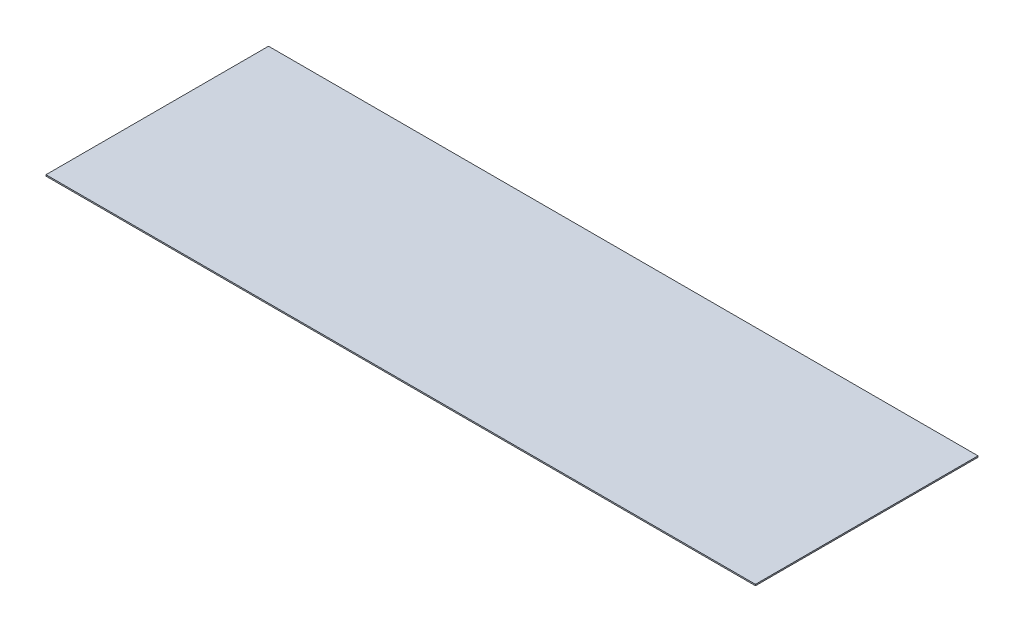
ISO-10303-21;
HEADER;
FILE_DESCRIPTION(('STEP AP214'),'2;1');
FILE_NAME('part.step','',(''),(''),'','','');
FILE_SCHEMA(('AUTOMOTIVE_DESIGN { 1 0 10303 214 1 1 1 1 }'));
ENDSEC;
DATA;
#1=APPLICATION_CONTEXT('core data for automotive mechanical design processes');
#2=APPLICATION_PROTOCOL_DEFINITION('international standard','automotive_design',2000,#1);
#3=PRODUCT_CONTEXT('',#1,'mechanical');
#4=PRODUCT('Part','Part','',(#3));
#5=PRODUCT_RELATED_PRODUCT_CATEGORY('part','',(#4));
#6=PRODUCT_DEFINITION_FORMATION('','',#4);
#7=PRODUCT_DEFINITION_CONTEXT('part definition',#1,'design');
#8=PRODUCT_DEFINITION('design','',#6,#7);
#9=PRODUCT_DEFINITION_SHAPE('','',#8);
#10=(LENGTH_UNIT() NAMED_UNIT(*) SI_UNIT(.MILLI.,.METRE.));
#11=(NAMED_UNIT(*) PLANE_ANGLE_UNIT() SI_UNIT($,.RADIAN.));
#12=(NAMED_UNIT(*) SI_UNIT($,.STERADIAN.) SOLID_ANGLE_UNIT());
#13=UNCERTAINTY_MEASURE_WITH_UNIT(LENGTH_MEASURE(1.E-05),#10,'distance_accuracy_value','');
#14=(GEOMETRIC_REPRESENTATION_CONTEXT(3) GLOBAL_UNCERTAINTY_ASSIGNED_CONTEXT((#13)) GLOBAL_UNIT_ASSIGNED_CONTEXT((#10,
#11,#12)) REPRESENTATION_CONTEXT('',''));
#15=CARTESIAN_POINT('',(0.,0.,0.));
#16=DIRECTION('',(0.,0.,1.));
#17=DIRECTION('',(1.,0.,0.));
#18=AXIS2_PLACEMENT_3D('',#15,#16,#17);
#19=CARTESIAN_POINT('',(271.,1.,85.));
#20=DIRECTION('',(-1.,0.,0.));
#21=DIRECTION('',(0.,0.,1.));
#22=AXIS2_PLACEMENT_3D('',#19,#20,#21);
#23=PLANE('',#22);
#24=DIRECTION('',(0.,0.,-1.));
#25=VECTOR('',#24,1.);
#26=CARTESIAN_POINT('',(271.,0.,85.));
#27=LINE('',#26,#25);
#28=CARTESIAN_POINT('',(271.,0.,85.));
#29=VERTEX_POINT('',#28);
#30=CARTESIAN_POINT('',(271.,0.,-85.0000000000001));
#31=VERTEX_POINT('',#30);
#32=EDGE_CURVE('E99',#29,#31,#27,.T.);
#33=ORIENTED_EDGE('',*,*,#32,.T.);
#34=DIRECTION('',(0.,-1.,0.));
#35=VECTOR('',#34,1.);
#36=CARTESIAN_POINT('',(271.,1.,-85.0000000000001));
#37=LINE('',#36,#35);
#38=CARTESIAN_POINT('',(271.,1.,-85.0000000000001));
#39=VERTEX_POINT('',#38);
#40=EDGE_CURVE('E11',#39,#31,#37,.T.);
#41=ORIENTED_EDGE('',*,*,#40,.F.);
#42=DIRECTION('',(0.,0.,-1.));
#43=VECTOR('',#42,1.);
#44=CARTESIAN_POINT('',(271.,1.,85.));
#45=LINE('',#44,#43);
#46=CARTESIAN_POINT('',(271.,1.,85.));
#47=VERTEX_POINT('',#46);
#48=EDGE_CURVE('E87',#47,#39,#45,.T.);
#49=ORIENTED_EDGE('',*,*,#48,.F.);
#50=DIRECTION('',(0.,-1.,0.));
#51=VECTOR('',#50,1.);
#52=CARTESIAN_POINT('',(271.,1.,85.));
#53=LINE('',#52,#51);
#54=EDGE_CURVE('E95',#47,#29,#53,.T.);
#55=ORIENTED_EDGE('',*,*,#54,.T.);
#56=EDGE_LOOP('',(#33,#41,#49,#55));
#57=FACE_BOUND('',#56,.T.);
#58=ADVANCED_FACE('F36',(#57),#23,.F.);
#59=CARTESIAN_POINT('',(-271.,1.,-85.0000000000001));
#60=DIRECTION('',(0.,0.,1.));
#61=DIRECTION('',(1.,0.,0.));
#62=AXIS2_PLACEMENT_3D('',#59,#60,#61);
#63=PLANE('',#62);
#64=DIRECTION('',(-1.,0.,0.));
#65=VECTOR('',#64,1.);
#66=CARTESIAN_POINT('',(-271.,0.,-85.0000000000001));
#67=LINE('',#66,#65);
#68=CARTESIAN_POINT('',(-271.,0.,-85.0000000000001));
#69=VERTEX_POINT('',#68);
#70=EDGE_CURVE('E91',#31,#69,#67,.T.);
#71=ORIENTED_EDGE('',*,*,#70,.T.);
#72=DIRECTION('',(0.,-1.,0.));
#73=VECTOR('',#72,1.);
#74=CARTESIAN_POINT('',(-271.,1.,-85.0000000000001));
#75=LINE('',#74,#73);
#76=CARTESIAN_POINT('',(-271.,1.,-85.0000000000001));
#77=VERTEX_POINT('',#76);
#78=EDGE_CURVE('E44',#77,#69,#75,.T.);
#79=ORIENTED_EDGE('',*,*,#78,.F.);
#80=DIRECTION('',(-1.,0.,0.));
#81=VECTOR('',#80,1.);
#82=CARTESIAN_POINT('',(-271.,1.,-85.0000000000001));
#83=LINE('',#82,#81);
#84=EDGE_CURVE('E82',#39,#77,#83,.T.);
#85=ORIENTED_EDGE('',*,*,#84,.F.);
#86=ORIENTED_EDGE('',*,*,#40,.T.);
#87=EDGE_LOOP('',(#71,#79,#85,#86));
#88=FACE_BOUND('',#87,.T.);
#89=ADVANCED_FACE('F90',(#88),#63,.F.);
#90=CARTESIAN_POINT('',(-271.,1.,85.));
#91=DIRECTION('',(1.,0.,0.));
#92=DIRECTION('',(0.,0.,-1.));
#93=AXIS2_PLACEMENT_3D('',#90,#91,#92);
#94=PLANE('',#93);
#95=DIRECTION('',(0.,0.,1.));
#96=VECTOR('',#95,1.);
#97=CARTESIAN_POINT('',(-271.,0.,85.));
#98=LINE('',#97,#96);
#99=CARTESIAN_POINT('',(-271.,0.,85.));
#100=VERTEX_POINT('',#99);
#101=EDGE_CURVE('E69',#69,#100,#98,.T.);
#102=ORIENTED_EDGE('',*,*,#101,.T.);
#103=DIRECTION('',(0.,-1.,0.));
#104=VECTOR('',#103,1.);
#105=CARTESIAN_POINT('',(-271.,1.,85.));
#106=LINE('',#105,#104);
#107=CARTESIAN_POINT('',(-271.,1.,85.));
#108=VERTEX_POINT('',#107);
#109=EDGE_CURVE('E92',#108,#100,#106,.T.);
#110=ORIENTED_EDGE('',*,*,#109,.F.);
#111=DIRECTION('',(0.,0.,1.));
#112=VECTOR('',#111,1.);
#113=CARTESIAN_POINT('',(-271.,1.,85.));
#114=LINE('',#113,#112);
#115=EDGE_CURVE('E85',#77,#108,#114,.T.);
#116=ORIENTED_EDGE('',*,*,#115,.F.);
#117=ORIENTED_EDGE('',*,*,#78,.T.);
#118=EDGE_LOOP('',(#102,#110,#116,#117));
#119=FACE_BOUND('',#118,.T.);
#120=ADVANCED_FACE('F93',(#119),#94,.F.);
#121=CARTESIAN_POINT('',(-271.,1.,85.));
#122=DIRECTION('',(0.,0.,-1.));
#123=DIRECTION('',(-1.,0.,0.));
#124=AXIS2_PLACEMENT_3D('',#121,#122,#123);
#125=PLANE('',#124);
#126=DIRECTION('',(1.,0.,0.));
#127=VECTOR('',#126,1.);
#128=CARTESIAN_POINT('',(-271.,0.,85.));
#129=LINE('',#128,#127);
#130=EDGE_CURVE('E75',#100,#29,#129,.T.);
#131=ORIENTED_EDGE('',*,*,#130,.T.);
#132=ORIENTED_EDGE('',*,*,#54,.F.);
#133=DIRECTION('',(1.,0.,0.));
#134=VECTOR('',#133,1.);
#135=CARTESIAN_POINT('',(-271.,1.,85.));
#136=LINE('',#135,#134);
#137=EDGE_CURVE('E52',#108,#47,#136,.T.);
#138=ORIENTED_EDGE('',*,*,#137,.F.);
#139=ORIENTED_EDGE('',*,*,#109,.T.);
#140=EDGE_LOOP('',(#131,#132,#138,#139));
#141=FACE_BOUND('',#140,.T.);
#142=ADVANCED_FACE('F106',(#141),#125,.F.);
#143=CARTESIAN_POINT('',(0.,1.,0.));
#144=DIRECTION('',(0.,-1.,0.));
#145=DIRECTION('',(0.,0.,-1.));
#146=AXIS2_PLACEMENT_3D('',#143,#144,#145);
#147=PLANE('',#146);
#148=ORIENTED_EDGE('',*,*,#48,.T.);
#149=ORIENTED_EDGE('',*,*,#84,.T.);
#150=ORIENTED_EDGE('',*,*,#115,.T.);
#151=ORIENTED_EDGE('',*,*,#137,.T.);
#152=EDGE_LOOP('',(#148,#149,#150,#151));
#153=FACE_BOUND('',#152,.T.);
#154=ADVANCED_FACE('F83',(#153),#147,.F.);
#155=CARTESIAN_POINT('',(0.,0.,0.));
#156=DIRECTION('',(0.,-1.,0.));
#157=DIRECTION('',(0.,0.,-1.));
#158=AXIS2_PLACEMENT_3D('',#155,#156,#157);
#159=PLANE('',#158);
#160=ORIENTED_EDGE('',*,*,#32,.F.);
#161=ORIENTED_EDGE('',*,*,#130,.F.);
#162=ORIENTED_EDGE('',*,*,#101,.F.);
#163=ORIENTED_EDGE('',*,*,#70,.F.);
#164=EDGE_LOOP('',(#160,#161,#162,#163));
#165=FACE_BOUND('',#164,.T.);
#166=ADVANCED_FACE('F109',(#165),#159,.T.);
#167=CLOSED_SHELL('',(#58,#89,#120,#142,#154,#166));
#168=MANIFOLD_SOLID_BREP('B2',#167);
#169=ADVANCED_BREP_SHAPE_REPRESENTATION('',(#18,#168),#14);
#170=SHAPE_DEFINITION_REPRESENTATION(#9,#169);
ENDSEC;
END-ISO-10303-21;
